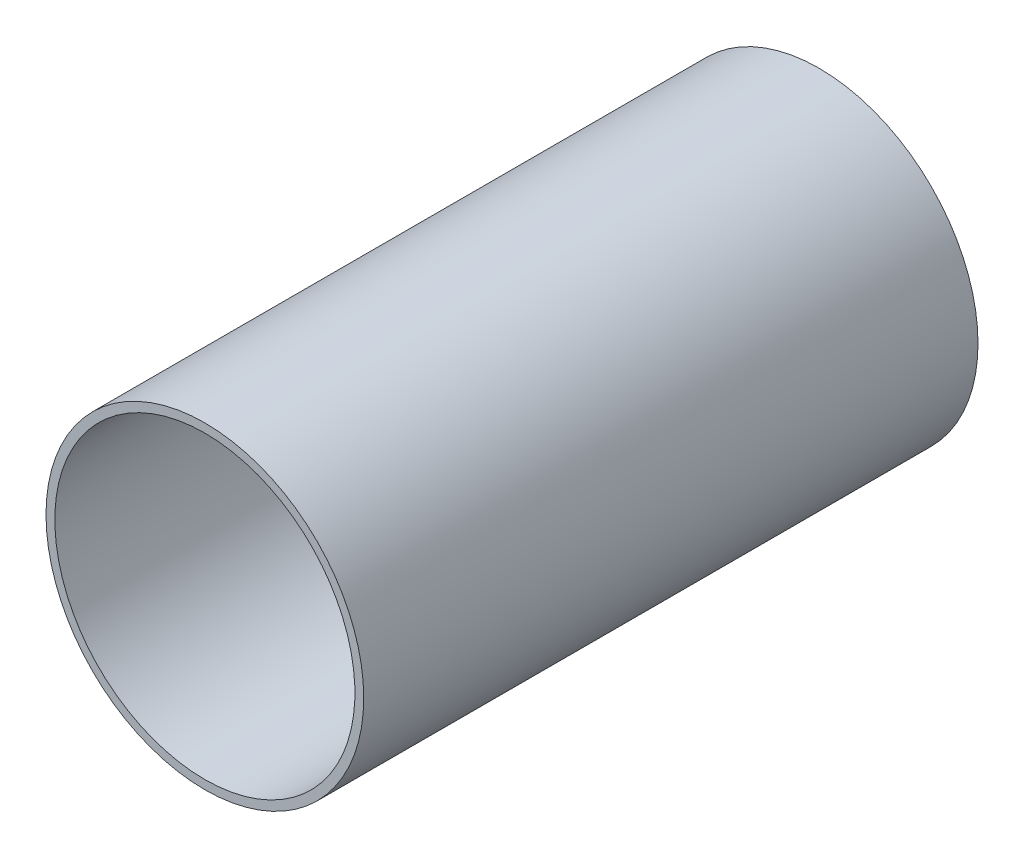
ISO-10303-21;
HEADER;
FILE_DESCRIPTION(('STEP AP214'),'2;1');
FILE_NAME('part.step','',(''),(''),'','','');
FILE_SCHEMA(('AUTOMOTIVE_DESIGN { 1 0 10303 214 1 1 1 1 }'));
ENDSEC;
DATA;
#1=APPLICATION_CONTEXT('core data for automotive mechanical design processes');
#2=APPLICATION_PROTOCOL_DEFINITION('international standard','automotive_design',2000,#1);
#3=PRODUCT_CONTEXT('',#1,'mechanical');
#4=PRODUCT('Part','Part','',(#3));
#5=PRODUCT_RELATED_PRODUCT_CATEGORY('part','',(#4));
#6=PRODUCT_DEFINITION_FORMATION('','',#4);
#7=PRODUCT_DEFINITION_CONTEXT('part definition',#1,'design');
#8=PRODUCT_DEFINITION('design','',#6,#7);
#9=PRODUCT_DEFINITION_SHAPE('','',#8);
#10=(LENGTH_UNIT() NAMED_UNIT(*) SI_UNIT(.MILLI.,.METRE.));
#11=(NAMED_UNIT(*) PLANE_ANGLE_UNIT() SI_UNIT($,.RADIAN.));
#12=(NAMED_UNIT(*) SI_UNIT($,.STERADIAN.) SOLID_ANGLE_UNIT());
#13=UNCERTAINTY_MEASURE_WITH_UNIT(LENGTH_MEASURE(1.E-05),#10,'distance_accuracy_value','');
#14=(GEOMETRIC_REPRESENTATION_CONTEXT(3) GLOBAL_UNCERTAINTY_ASSIGNED_CONTEXT((#13)) GLOBAL_UNIT_ASSIGNED_CONTEXT((#10,
#11,#12)) REPRESENTATION_CONTEXT('',''));
#15=CARTESIAN_POINT('',(0.,0.,0.));
#16=DIRECTION('',(0.,0.,1.));
#17=DIRECTION('',(1.,0.,0.));
#18=AXIS2_PLACEMENT_3D('',#15,#16,#17);
#19=CARTESIAN_POINT('',(119.6898,-71.2108,-0.045));
#20=DIRECTION('',(0.,0.,-1.));
#21=DIRECTION('',(0.,-1.,0.));
#22=AXIS2_PLACEMENT_3D('',#19,#20,#21);
#23=CYLINDRICAL_SURFACE('',#22,0.425);
#24=CARTESIAN_POINT('',(119.6898,-71.2108,-0.035));
#25=DIRECTION('',(0.,0.,-1.));
#26=DIRECTION('',(0.,-1.,0.));
#27=AXIS2_PLACEMENT_3D('',#24,#25,#26);
#28=CIRCLE('',#27,0.425);
#29=CARTESIAN_POINT('',(119.6898,-71.6358,-0.035));
#30=VERTEX_POINT('',#29);
#31=EDGE_CURVE('E64',#30,#30,#28,.T.);
#32=ORIENTED_EDGE('',*,*,#31,.T.);
#33=DIRECTION('',(0.,0.,1.));
#34=VECTOR('',#33,1.);
#35=CARTESIAN_POINT('',(119.6898,-71.6358,-0.045));
#36=LINE('',#35,#34);
#37=CARTESIAN_POINT('',(119.6898,-71.6358,1.705));
#38=VERTEX_POINT('',#37);
#39=EDGE_CURVE('E11',#30,#38,#36,.T.);
#40=ORIENTED_EDGE('',*,*,#39,.T.);
#41=CARTESIAN_POINT('',(119.6898,-71.2108,1.705));
#42=DIRECTION('',(0.,0.,-1.));
#43=DIRECTION('',(0.,-1.,0.));
#44=AXIS2_PLACEMENT_3D('',#41,#42,#43);
#45=CIRCLE('',#44,0.425);
#46=EDGE_CURVE('E25',#38,#38,#45,.T.);
#47=ORIENTED_EDGE('',*,*,#46,.F.);
#48=ORIENTED_EDGE('',*,*,#39,.F.);
#49=EDGE_LOOP('',(#32,#40,#47,#48));
#50=FACE_BOUND('',#49,.T.);
#51=ADVANCED_FACE('F17',(#50),#23,.F.);
#52=CARTESIAN_POINT('',(119.6898,-71.6608,1.705));
#53=DIRECTION('',(0.,0.,1.));
#54=DIRECTION('',(1.,0.,0.));
#55=AXIS2_PLACEMENT_3D('',#52,#53,#54);
#56=PLANE('',#55);
#57=ORIENTED_EDGE('',*,*,#46,.T.);
#58=EDGE_LOOP('',(#57));
#59=FACE_BOUND('',#58,.T.);
#60=CARTESIAN_POINT('',(119.6898,-71.2108,1.705));
#61=DIRECTION('',(0.,0.,1.));
#62=DIRECTION('',(0.,-1.,0.));
#63=AXIS2_PLACEMENT_3D('',#60,#61,#62);
#64=CIRCLE('',#63,0.45);
#65=CARTESIAN_POINT('',(119.6898,-71.6608,1.705));
#66=VERTEX_POINT('',#65);
#67=EDGE_CURVE('E56',#66,#66,#64,.T.);
#68=ORIENTED_EDGE('',*,*,#67,.T.);
#69=EDGE_LOOP('',(#68));
#70=FACE_BOUND('',#69,.T.);
#71=ADVANCED_FACE('F73',(#59,#70),#56,.T.);
#72=CARTESIAN_POINT('',(119.6898,-71.6608,-0.035));
#73=DIRECTION('',(0.,0.,1.));
#74=DIRECTION('',(1.,0.,0.));
#75=AXIS2_PLACEMENT_3D('',#72,#73,#74);
#76=PLANE('',#75);
#77=ORIENTED_EDGE('',*,*,#31,.F.);
#78=EDGE_LOOP('',(#77));
#79=FACE_BOUND('',#78,.T.);
#80=CARTESIAN_POINT('',(119.6898,-71.2108,-0.035));
#81=DIRECTION('',(0.,0.,1.));
#82=DIRECTION('',(0.,-1.,0.));
#83=AXIS2_PLACEMENT_3D('',#80,#81,#82);
#84=CIRCLE('',#83,0.45);
#85=CARTESIAN_POINT('',(119.6898,-71.6608,-0.035));
#86=VERTEX_POINT('',#85);
#87=EDGE_CURVE('E55',#86,#86,#84,.T.);
#88=ORIENTED_EDGE('',*,*,#87,.F.);
#89=EDGE_LOOP('',(#88));
#90=FACE_BOUND('',#89,.T.);
#91=ADVANCED_FACE('F82',(#79,#90),#76,.F.);
#92=CARTESIAN_POINT('',(119.6898,-71.2108,-0.035));
#93=DIRECTION('',(0.,0.,-1.));
#94=DIRECTION('',(0.,-1.,0.));
#95=AXIS2_PLACEMENT_3D('',#92,#93,#94);
#96=CYLINDRICAL_SURFACE('',#95,0.45);
#97=ORIENTED_EDGE('',*,*,#87,.T.);
#98=DIRECTION('',(0.,0.,1.));
#99=VECTOR('',#98,1.);
#100=CARTESIAN_POINT('',(119.6898,-71.6608,-0.035));
#101=LINE('',#100,#99);
#102=EDGE_CURVE('E52',#86,#66,#101,.T.);
#103=ORIENTED_EDGE('',*,*,#102,.T.);
#104=ORIENTED_EDGE('',*,*,#67,.F.);
#105=ORIENTED_EDGE('',*,*,#102,.F.);
#106=EDGE_LOOP('',(#97,#103,#104,#105));
#107=FACE_BOUND('',#106,.T.);
#108=ADVANCED_FACE('F53',(#107),#96,.T.);
#109=CLOSED_SHELL('',(#51,#71,#91,#108));
#110=MANIFOLD_SOLID_BREP('B1',#109);
#111=ADVANCED_BREP_SHAPE_REPRESENTATION('',(#18,#110),#14);
#112=SHAPE_DEFINITION_REPRESENTATION(#9,#111);
ENDSEC;
END-ISO-10303-21;
